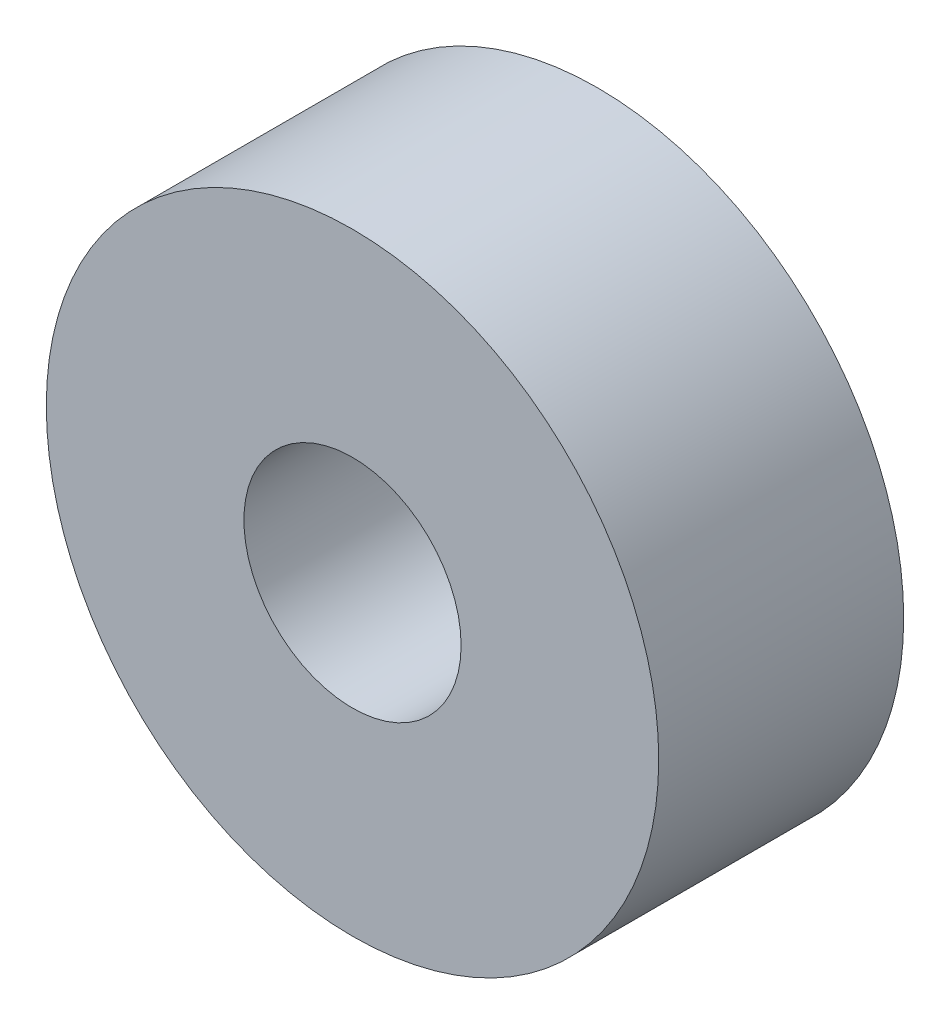
ISO-10303-21;
HEADER;
FILE_DESCRIPTION(('STEP AP214'),'2;1');
FILE_NAME('part.step','',(''),(''),'','','');
FILE_SCHEMA(('AUTOMOTIVE_DESIGN { 1 0 10303 214 1 1 1 1 }'));
ENDSEC;
DATA;
#1=APPLICATION_CONTEXT('core data for automotive mechanical design processes');
#2=APPLICATION_PROTOCOL_DEFINITION('international standard','automotive_design',2000,#1);
#3=PRODUCT_CONTEXT('',#1,'mechanical');
#4=PRODUCT('Part','Part','',(#3));
#5=PRODUCT_RELATED_PRODUCT_CATEGORY('part','',(#4));
#6=PRODUCT_DEFINITION_FORMATION('','',#4);
#7=PRODUCT_DEFINITION_CONTEXT('part definition',#1,'design');
#8=PRODUCT_DEFINITION('design','',#6,#7);
#9=PRODUCT_DEFINITION_SHAPE('','',#8);
#10=(LENGTH_UNIT() NAMED_UNIT(*) SI_UNIT(.MILLI.,.METRE.));
#11=(NAMED_UNIT(*) PLANE_ANGLE_UNIT() SI_UNIT($,.RADIAN.));
#12=(NAMED_UNIT(*) SI_UNIT($,.STERADIAN.) SOLID_ANGLE_UNIT());
#13=UNCERTAINTY_MEASURE_WITH_UNIT(LENGTH_MEASURE(1.E-05),#10,'distance_accuracy_value','');
#14=(GEOMETRIC_REPRESENTATION_CONTEXT(3) GLOBAL_UNCERTAINTY_ASSIGNED_CONTEXT((#13)) GLOBAL_UNIT_ASSIGNED_CONTEXT((#10,
#11,#12)) REPRESENTATION_CONTEXT('',''));
#15=CARTESIAN_POINT('',(0.,0.,0.));
#16=DIRECTION('',(0.,0.,1.));
#17=DIRECTION('',(1.,0.,0.));
#18=AXIS2_PLACEMENT_3D('',#15,#16,#17);
#19=CARTESIAN_POINT('',(0.,0.,3.81));
#20=DIRECTION('',(0.,0.,-1.));
#21=DIRECTION('',(-1.,0.,0.));
#22=AXIS2_PLACEMENT_3D('',#19,#20,#21);
#23=CYLINDRICAL_SURFACE('',#22,9.525);
#24=CARTESIAN_POINT('',(0.,0.,3.81));
#25=DIRECTION('',(0.,0.,1.));
#26=DIRECTION('',(1.,0.,0.));
#27=AXIS2_PLACEMENT_3D('',#24,#25,#26);
#28=CIRCLE('',#27,9.525);
#29=CARTESIAN_POINT('',(9.525,0.,3.81));
#30=VERTEX_POINT('',#29);
#31=EDGE_CURVE('E10',#30,#30,#28,.T.);
#32=ORIENTED_EDGE('',*,*,#31,.F.);
#33=EDGE_LOOP('',(#32));
#34=FACE_BOUND('',#33,.T.);
#35=CARTESIAN_POINT('',(0.,0.,-3.81));
#36=DIRECTION('',(0.,0.,1.));
#37=DIRECTION('',(1.,0.,0.));
#38=AXIS2_PLACEMENT_3D('',#35,#36,#37);
#39=CIRCLE('',#38,9.525);
#40=CARTESIAN_POINT('',(9.525,0.,-3.81));
#41=VERTEX_POINT('',#40);
#42=EDGE_CURVE('E37',#41,#41,#39,.T.);
#43=ORIENTED_EDGE('',*,*,#42,.T.);
#44=EDGE_LOOP('',(#43));
#45=FACE_BOUND('',#44,.T.);
#46=ADVANCED_FACE('F34',(#34,#45),#23,.T.);
#47=CARTESIAN_POINT('',(0.,0.,3.81));
#48=DIRECTION('',(0.,0.,1.));
#49=DIRECTION('',(1.,0.,0.));
#50=AXIS2_PLACEMENT_3D('',#47,#48,#49);
#51=PLANE('',#50);
#52=CARTESIAN_POINT('',(0.,0.,3.81));
#53=DIRECTION('',(0.,0.,1.));
#54=DIRECTION('',(1.,0.,0.));
#55=AXIS2_PLACEMENT_3D('',#52,#53,#54);
#56=CIRCLE('',#55,3.3782);
#57=CARTESIAN_POINT('',(3.3782,0.,3.81));
#58=VERTEX_POINT('',#57);
#59=EDGE_CURVE('E48',#58,#58,#56,.T.);
#60=ORIENTED_EDGE('',*,*,#59,.F.);
#61=EDGE_LOOP('',(#60));
#62=FACE_BOUND('',#61,.T.);
#63=ORIENTED_EDGE('',*,*,#31,.T.);
#64=EDGE_LOOP('',(#63));
#65=FACE_BOUND('',#64,.T.);
#66=ADVANCED_FACE('F55',(#62,#65),#51,.T.);
#67=CARTESIAN_POINT('',(0.,0.,-3.81));
#68=DIRECTION('',(0.,0.,1.));
#69=DIRECTION('',(1.,0.,0.));
#70=AXIS2_PLACEMENT_3D('',#67,#68,#69);
#71=PLANE('',#70);
#72=CARTESIAN_POINT('',(0.,0.,-3.81));
#73=DIRECTION('',(0.,0.,1.));
#74=DIRECTION('',(1.,0.,0.));
#75=AXIS2_PLACEMENT_3D('',#72,#73,#74);
#76=CIRCLE('',#75,3.3782);
#77=CARTESIAN_POINT('',(3.3782,0.,-3.81));
#78=VERTEX_POINT('',#77);
#79=EDGE_CURVE('E44',#78,#78,#76,.F.);
#80=ORIENTED_EDGE('',*,*,#79,.F.);
#81=EDGE_LOOP('',(#80));
#82=FACE_BOUND('',#81,.T.);
#83=ORIENTED_EDGE('',*,*,#42,.F.);
#84=EDGE_LOOP('',(#83));
#85=FACE_BOUND('',#84,.T.);
#86=ADVANCED_FACE('F57',(#82,#85),#71,.F.);
#87=CARTESIAN_POINT('',(0.,0.,-3.811));
#88=DIRECTION('',(0.,0.,1.));
#89=DIRECTION('',(1.,0.,0.));
#90=AXIS2_PLACEMENT_3D('',#87,#88,#89);
#91=CYLINDRICAL_SURFACE('',#90,3.3782);
#92=ORIENTED_EDGE('',*,*,#59,.T.);
#93=EDGE_LOOP('',(#92));
#94=FACE_BOUND('',#93,.T.);
#95=ORIENTED_EDGE('',*,*,#79,.T.);
#96=EDGE_LOOP('',(#95));
#97=FACE_BOUND('',#96,.T.);
#98=ADVANCED_FACE('F52',(#94,#97),#91,.F.);
#99=CLOSED_SHELL('',(#46,#66,#86,#98));
#100=MANIFOLD_SOLID_BREP('B2',#99);
#101=ADVANCED_BREP_SHAPE_REPRESENTATION('',(#18,#100),#14);
#102=SHAPE_DEFINITION_REPRESENTATION(#9,#101);
ENDSEC;
END-ISO-10303-21;
